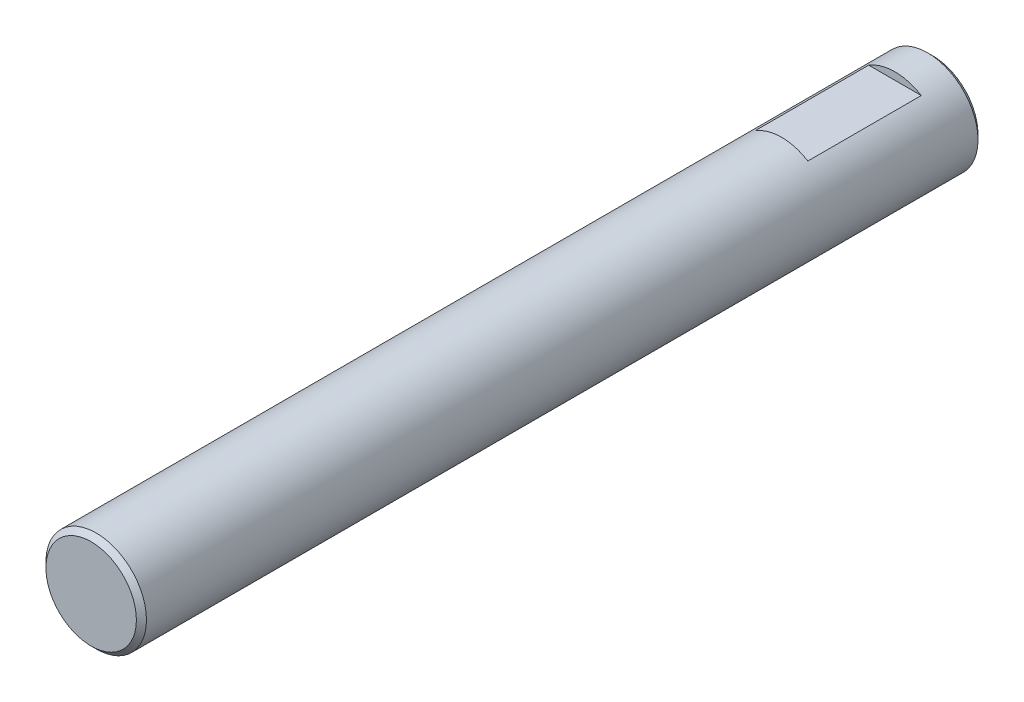
ISO-10303-21;
HEADER;
FILE_DESCRIPTION(('STEP AP214'),'2;1');
FILE_NAME('part.step','',(''),(''),'','','');
FILE_SCHEMA(('AUTOMOTIVE_DESIGN { 1 0 10303 214 1 1 1 1 }'));
ENDSEC;
DATA;
#1=APPLICATION_CONTEXT('core data for automotive mechanical design processes');
#2=APPLICATION_PROTOCOL_DEFINITION('international standard','automotive_design',2000,#1);
#3=PRODUCT_CONTEXT('',#1,'mechanical');
#4=PRODUCT('Part','Part','',(#3));
#5=PRODUCT_RELATED_PRODUCT_CATEGORY('part','',(#4));
#6=PRODUCT_DEFINITION_FORMATION('','',#4);
#7=PRODUCT_DEFINITION_CONTEXT('part definition',#1,'design');
#8=PRODUCT_DEFINITION('design','',#6,#7);
#9=PRODUCT_DEFINITION_SHAPE('','',#8);
#10=(LENGTH_UNIT() NAMED_UNIT(*) SI_UNIT(.MILLI.,.METRE.));
#11=(NAMED_UNIT(*) PLANE_ANGLE_UNIT() SI_UNIT($,.RADIAN.));
#12=(NAMED_UNIT(*) SI_UNIT($,.STERADIAN.) SOLID_ANGLE_UNIT());
#13=UNCERTAINTY_MEASURE_WITH_UNIT(LENGTH_MEASURE(1.E-05),#10,'distance_accuracy_value','');
#14=(GEOMETRIC_REPRESENTATION_CONTEXT(3) GLOBAL_UNCERTAINTY_ASSIGNED_CONTEXT((#13)) GLOBAL_UNIT_ASSIGNED_CONTEXT((#10,
#11,#12)) REPRESENTATION_CONTEXT('',''));
#15=CARTESIAN_POINT('',(0.,0.,0.));
#16=DIRECTION('',(0.,0.,1.));
#17=DIRECTION('',(1.,0.,0.));
#18=AXIS2_PLACEMENT_3D('',#15,#16,#17);
#19=CARTESIAN_POINT('',(0.,0.,33.4));
#20=DIRECTION('',(0.,0.,-1.));
#21=DIRECTION('',(-1.,0.,0.));
#22=AXIS2_PLACEMENT_3D('',#19,#20,#21);
#23=CYLINDRICAL_SURFACE('',#22,1.995);
#24=CARTESIAN_POINT('',(0.,0.,33.2));
#25=DIRECTION('',(0.,0.,1.));
#26=DIRECTION('',(1.,0.,0.));
#27=AXIS2_PLACEMENT_3D('',#24,#25,#26);
#28=CIRCLE('',#27,1.995);
#29=CARTESIAN_POINT('',(1.995,0.,33.2));
#30=VERTEX_POINT('',#29);
#31=EDGE_CURVE('E51',#30,#30,#28,.F.);
#32=ORIENTED_EDGE('',*,*,#31,.T.);
#33=EDGE_LOOP('',(#32));
#34=FACE_BOUND('',#33,.T.);
#35=CARTESIAN_POINT('',(0.,0.,0.199999999999992));
#36=DIRECTION('',(0.,0.,1.));
#37=DIRECTION('',(1.,0.,0.));
#38=AXIS2_PLACEMENT_3D('',#35,#36,#37);
#39=CIRCLE('',#38,1.995);
#40=CARTESIAN_POINT('',(1.995,0.,0.199999999999992));
#41=VERTEX_POINT('',#40);
#42=EDGE_CURVE('E128',#41,#41,#39,.T.);
#43=ORIENTED_EDGE('',*,*,#42,.T.);
#44=EDGE_LOOP('',(#43));
#45=FACE_BOUND('',#44,.T.);
#46=DIRECTION('',(0.,0.,-1.));
#47=VECTOR('',#46,1.);
#48=CARTESIAN_POINT('',(-1.04404262365097,1.7,33.4));
#49=LINE('',#48,#47);
#50=CARTESIAN_POINT('',(-1.04404262365097,1.7,6.));
#51=VERTEX_POINT('',#50);
#52=CARTESIAN_POINT('',(-1.04404262365097,1.7,1.5));
#53=VERTEX_POINT('',#52);
#54=EDGE_CURVE('E116',#51,#53,#49,.T.);
#55=ORIENTED_EDGE('',*,*,#54,.T.);
#56=CARTESIAN_POINT('',(0.,0.,1.5));
#57=DIRECTION('',(0.,0.,-1.));
#58=DIRECTION('',(-1.,0.,0.));
#59=AXIS2_PLACEMENT_3D('',#56,#57,#58);
#60=CIRCLE('',#59,1.995);
#61=CARTESIAN_POINT('',(1.04404262365097,1.7,1.5));
#62=VERTEX_POINT('',#61);
#63=EDGE_CURVE('E120',#53,#62,#60,.T.);
#64=ORIENTED_EDGE('',*,*,#63,.T.);
#65=DIRECTION('',(0.,0.,-1.));
#66=VECTOR('',#65,1.);
#67=CARTESIAN_POINT('',(1.04404262365097,1.7,33.4));
#68=LINE('',#67,#66);
#69=CARTESIAN_POINT('',(1.04404262365097,1.7,6.));
#70=VERTEX_POINT('',#69);
#71=EDGE_CURVE('E112',#62,#70,#68,.F.);
#72=ORIENTED_EDGE('',*,*,#71,.T.);
#73=CARTESIAN_POINT('',(0.,0.,6.));
#74=DIRECTION('',(0.,0.,1.));
#75=DIRECTION('',(1.,0.,0.));
#76=AXIS2_PLACEMENT_3D('',#73,#74,#75);
#77=CIRCLE('',#76,1.995);
#78=EDGE_CURVE('E105',#70,#51,#77,.T.);
#79=ORIENTED_EDGE('',*,*,#78,.T.);
#80=EDGE_LOOP('',(#55,#64,#72,#79));
#81=FACE_BOUND('',#80,.T.);
#82=DIRECTION('',(0.,0.,-1.));
#83=VECTOR('',#82,1.);
#84=CARTESIAN_POINT('',(-1.04404262365097,-1.7,33.4));
#85=LINE('',#84,#83);
#86=CARTESIAN_POINT('',(-1.04404262365097,-1.7,1.5));
#87=VERTEX_POINT('',#86);
#88=CARTESIAN_POINT('',(-1.04404262365097,-1.7,6.));
#89=VERTEX_POINT('',#88);
#90=EDGE_CURVE('E88',#87,#89,#85,.F.);
#91=ORIENTED_EDGE('',*,*,#90,.T.);
#92=CARTESIAN_POINT('',(0.,0.,6.));
#93=DIRECTION('',(0.,0.,1.));
#94=DIRECTION('',(1.,0.,0.));
#95=AXIS2_PLACEMENT_3D('',#92,#93,#94);
#96=CIRCLE('',#95,1.995);
#97=CARTESIAN_POINT('',(1.04404262365097,-1.7,6.));
#98=VERTEX_POINT('',#97);
#99=EDGE_CURVE('E100',#89,#98,#96,.T.);
#100=ORIENTED_EDGE('',*,*,#99,.T.);
#101=DIRECTION('',(0.,0.,-1.));
#102=VECTOR('',#101,1.);
#103=CARTESIAN_POINT('',(1.04404262365097,-1.7,33.4));
#104=LINE('',#103,#102);
#105=CARTESIAN_POINT('',(1.04404262365097,-1.7,1.5));
#106=VERTEX_POINT('',#105);
#107=EDGE_CURVE('E94',#98,#106,#104,.T.);
#108=ORIENTED_EDGE('',*,*,#107,.T.);
#109=CARTESIAN_POINT('',(0.,0.,1.5));
#110=DIRECTION('',(0.,0.,-1.));
#111=DIRECTION('',(-1.,0.,0.));
#112=AXIS2_PLACEMENT_3D('',#109,#110,#111);
#113=CIRCLE('',#112,1.995);
#114=EDGE_CURVE('E82',#106,#87,#113,.T.);
#115=ORIENTED_EDGE('',*,*,#114,.T.);
#116=EDGE_LOOP('',(#91,#100,#108,#115));
#117=FACE_BOUND('',#116,.T.);
#118=ADVANCED_FACE('F41',(#34,#45,#81,#117),#23,.T.);
#119=CARTESIAN_POINT('',(0.,0.,33.4));
#120=DIRECTION('',(0.,0.,1.));
#121=DIRECTION('',(1.,0.,0.));
#122=AXIS2_PLACEMENT_3D('',#119,#120,#121);
#123=PLANE('',#122);
#124=CARTESIAN_POINT('',(0.,0.,33.4));
#125=DIRECTION('',(0.,0.,1.));
#126=DIRECTION('',(1.,0.,0.));
#127=AXIS2_PLACEMENT_3D('',#124,#125,#126);
#128=CIRCLE('',#127,1.795);
#129=CARTESIAN_POINT('',(1.795,0.,33.4));
#130=VERTEX_POINT('',#129);
#131=EDGE_CURVE('E124',#130,#130,#128,.T.);
#132=ORIENTED_EDGE('',*,*,#131,.T.);
#133=EDGE_LOOP('',(#132));
#134=FACE_BOUND('',#133,.T.);
#135=ADVANCED_FACE('F143',(#134),#123,.T.);
#136=CARTESIAN_POINT('',(0.,0.,0.));
#137=DIRECTION('',(0.,0.,1.));
#138=DIRECTION('',(1.,0.,0.));
#139=AXIS2_PLACEMENT_3D('',#136,#137,#138);
#140=PLANE('',#139);
#141=CARTESIAN_POINT('',(0.,0.,0.));
#142=DIRECTION('',(0.,0.,1.));
#143=DIRECTION('',(1.,0.,0.));
#144=AXIS2_PLACEMENT_3D('',#141,#142,#143);
#145=CIRCLE('',#144,1.795);
#146=CARTESIAN_POINT('',(1.795,0.,0.));
#147=VERTEX_POINT('',#146);
#148=EDGE_CURVE('E11',#147,#147,#145,.F.);
#149=ORIENTED_EDGE('',*,*,#148,.T.);
#150=EDGE_LOOP('',(#149));
#151=FACE_BOUND('',#150,.T.);
#152=ADVANCED_FACE('F145',(#151),#140,.F.);
#153=CARTESIAN_POINT('',(-1.995,-2.62037787427485,6.));
#154=DIRECTION('',(0.,0.,1.));
#155=DIRECTION('',(1.,0.,0.));
#156=AXIS2_PLACEMENT_3D('',#153,#154,#155);
#157=PLANE('',#156);
#158=DIRECTION('',(1.,0.,0.));
#159=VECTOR('',#158,1.);
#160=CARTESIAN_POINT('',(-1.995,-1.7,6.));
#161=LINE('',#160,#159);
#162=EDGE_CURVE('E97',#89,#98,#161,.T.);
#163=ORIENTED_EDGE('',*,*,#162,.T.);
#164=ORIENTED_EDGE('',*,*,#99,.F.);
#165=EDGE_LOOP('',(#163,#164));
#166=FACE_BOUND('',#165,.T.);
#167=ADVANCED_FACE('F151',(#166),#157,.F.);
#168=CARTESIAN_POINT('',(-1.995,-1.7,1.5));
#169=DIRECTION('',(0.,1.,0.));
#170=DIRECTION('',(0.,0.,1.));
#171=AXIS2_PLACEMENT_3D('',#168,#169,#170);
#172=PLANE('',#171);
#173=ORIENTED_EDGE('',*,*,#162,.F.);
#174=ORIENTED_EDGE('',*,*,#90,.F.);
#175=DIRECTION('',(1.,0.,0.));
#176=VECTOR('',#175,1.);
#177=CARTESIAN_POINT('',(-1.995,-1.7,1.5));
#178=LINE('',#177,#176);
#179=EDGE_CURVE('E64',#87,#106,#178,.T.);
#180=ORIENTED_EDGE('',*,*,#179,.T.);
#181=ORIENTED_EDGE('',*,*,#107,.F.);
#182=EDGE_LOOP('',(#173,#174,#180,#181));
#183=FACE_BOUND('',#182,.T.);
#184=ADVANCED_FACE('F93',(#183),#172,.F.);
#185=CARTESIAN_POINT('',(-1.995,-2.62037787427485,1.5));
#186=DIRECTION('',(0.,0.,-1.));
#187=DIRECTION('',(-1.,0.,0.));
#188=AXIS2_PLACEMENT_3D('',#185,#186,#187);
#189=PLANE('',#188);
#190=ORIENTED_EDGE('',*,*,#179,.F.);
#191=ORIENTED_EDGE('',*,*,#114,.F.);
#192=EDGE_LOOP('',(#190,#191));
#193=FACE_BOUND('',#192,.T.);
#194=ADVANCED_FACE('F83',(#193),#189,.F.);
#195=CARTESIAN_POINT('',(-1.995,2.62037787427485,1.5));
#196=DIRECTION('',(0.,0.,-1.));
#197=DIRECTION('',(-1.,0.,0.));
#198=AXIS2_PLACEMENT_3D('',#195,#196,#197);
#199=PLANE('',#198);
#200=DIRECTION('',(1.,0.,0.));
#201=VECTOR('',#200,1.);
#202=CARTESIAN_POINT('',(-1.995,1.7,1.5));
#203=LINE('',#202,#201);
#204=EDGE_CURVE('E89',#53,#62,#203,.T.);
#205=ORIENTED_EDGE('',*,*,#204,.T.);
#206=ORIENTED_EDGE('',*,*,#63,.F.);
#207=EDGE_LOOP('',(#205,#206));
#208=FACE_BOUND('',#207,.T.);
#209=ADVANCED_FACE('F163',(#208),#199,.F.);
#210=CARTESIAN_POINT('',(-1.995,1.7,1.5));
#211=DIRECTION('',(0.,-1.,0.));
#212=DIRECTION('',(0.,0.,-1.));
#213=AXIS2_PLACEMENT_3D('',#210,#211,#212);
#214=PLANE('',#213);
#215=DIRECTION('',(1.,0.,0.));
#216=VECTOR('',#215,1.);
#217=CARTESIAN_POINT('',(-1.995,1.7,6.));
#218=LINE('',#217,#216);
#219=EDGE_CURVE('E57',#51,#70,#218,.T.);
#220=ORIENTED_EDGE('',*,*,#219,.T.);
#221=ORIENTED_EDGE('',*,*,#71,.F.);
#222=ORIENTED_EDGE('',*,*,#204,.F.);
#223=ORIENTED_EDGE('',*,*,#54,.F.);
#224=EDGE_LOOP('',(#220,#221,#222,#223));
#225=FACE_BOUND('',#224,.T.);
#226=ADVANCED_FACE('F171',(#225),#214,.F.);
#227=CARTESIAN_POINT('',(-1.995,2.62037787427485,6.));
#228=DIRECTION('',(0.,0.,1.));
#229=DIRECTION('',(1.,0.,0.));
#230=AXIS2_PLACEMENT_3D('',#227,#228,#229);
#231=PLANE('',#230);
#232=ORIENTED_EDGE('',*,*,#219,.F.);
#233=ORIENTED_EDGE('',*,*,#78,.F.);
#234=EDGE_LOOP('',(#232,#233));
#235=FACE_BOUND('',#234,.T.);
#236=ADVANCED_FACE('F140',(#235),#231,.F.);
#237=CARTESIAN_POINT('',(0.,0.,33.4));
#238=DIRECTION('',(0.,0.,-1.));
#239=DIRECTION('',(-1.,0.,0.));
#240=AXIS2_PLACEMENT_3D('',#237,#238,#239);
#241=CONICAL_SURFACE('',#240,1.795,0.78539816339744);
#242=ORIENTED_EDGE('',*,*,#31,.F.);
#243=EDGE_LOOP('',(#242));
#244=FACE_BOUND('',#243,.T.);
#245=ORIENTED_EDGE('',*,*,#131,.F.);
#246=EDGE_LOOP('',(#245));
#247=FACE_BOUND('',#246,.T.);
#248=ADVANCED_FACE('F137',(#244,#247),#241,.T.);
#249=CARTESIAN_POINT('',(0.,0.,0.199999999999992));
#250=DIRECTION('',(0.,0.,1.));
#251=DIRECTION('',(1.,0.,0.));
#252=AXIS2_PLACEMENT_3D('',#249,#250,#251);
#253=CONICAL_SURFACE('',#252,1.995,0.785398163397457);
#254=ORIENTED_EDGE('',*,*,#148,.F.);
#255=EDGE_LOOP('',(#254));
#256=FACE_BOUND('',#255,.T.);
#257=ORIENTED_EDGE('',*,*,#42,.F.);
#258=EDGE_LOOP('',(#257));
#259=FACE_BOUND('',#258,.T.);
#260=ADVANCED_FACE('F44',(#256,#259),#253,.T.);
#261=CLOSED_SHELL('',(#118,#135,#152,#167,#184,#194,#209,#226,#236,#248,#260));
#262=MANIFOLD_SOLID_BREP('B2',#261);
#263=ADVANCED_BREP_SHAPE_REPRESENTATION('',(#18,#262),#14);
#264=SHAPE_DEFINITION_REPRESENTATION(#9,#263);
ENDSEC;
END-ISO-10303-21;
